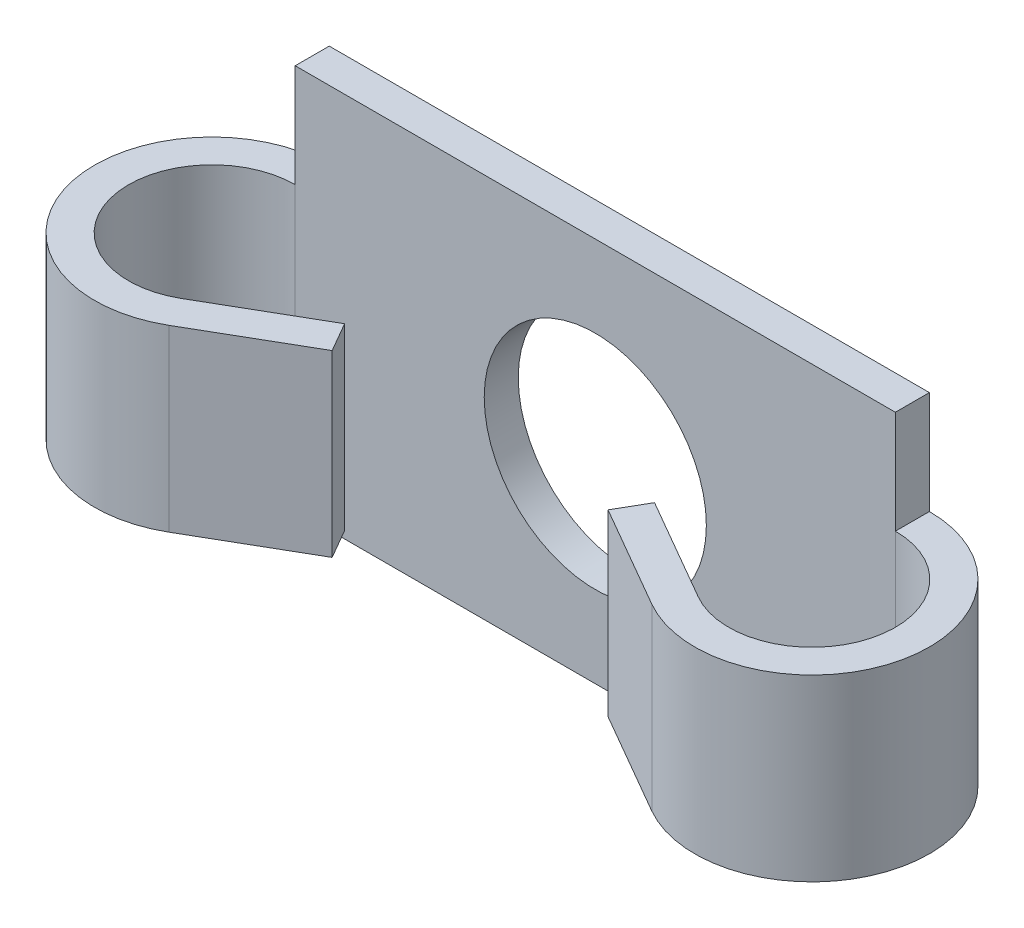
ISO-10303-21;
HEADER;
FILE_DESCRIPTION(('STEP AP214'),'2;1');
FILE_NAME('part.step','',(''),(''),'','','');
FILE_SCHEMA(('AUTOMOTIVE_DESIGN { 1 0 10303 214 1 1 1 1 }'));
ENDSEC;
DATA;
#1=APPLICATION_CONTEXT('core data for automotive mechanical design processes');
#2=APPLICATION_PROTOCOL_DEFINITION('international standard','automotive_design',2000,#1);
#3=PRODUCT_CONTEXT('',#1,'mechanical');
#4=PRODUCT('Part','Part','',(#3));
#5=PRODUCT_RELATED_PRODUCT_CATEGORY('part','',(#4));
#6=PRODUCT_DEFINITION_FORMATION('','',#4);
#7=PRODUCT_DEFINITION_CONTEXT('part definition',#1,'design');
#8=PRODUCT_DEFINITION('design','',#6,#7);
#9=PRODUCT_DEFINITION_SHAPE('','',#8);
#10=(LENGTH_UNIT() NAMED_UNIT(*) SI_UNIT(.MILLI.,.METRE.));
#11=(NAMED_UNIT(*) PLANE_ANGLE_UNIT() SI_UNIT($,.RADIAN.));
#12=(NAMED_UNIT(*) SI_UNIT($,.STERADIAN.) SOLID_ANGLE_UNIT());
#13=UNCERTAINTY_MEASURE_WITH_UNIT(LENGTH_MEASURE(1.E-05),#10,'distance_accuracy_value','');
#14=(GEOMETRIC_REPRESENTATION_CONTEXT(3) GLOBAL_UNCERTAINTY_ASSIGNED_CONTEXT((#13)) GLOBAL_UNIT_ASSIGNED_CONTEXT((#10,
#11,#12)) REPRESENTATION_CONTEXT('',''));
#15=CARTESIAN_POINT('',(0.,0.,0.));
#16=DIRECTION('',(0.,0.,1.));
#17=DIRECTION('',(1.,0.,0.));
#18=AXIS2_PLACEMENT_3D('',#15,#16,#17);
#19=CARTESIAN_POINT('',(16.75,-10.75,1.9));
#20=DIRECTION('',(-1.,0.,0.));
#21=DIRECTION('',(0.,0.,1.));
#22=AXIS2_PLACEMENT_3D('',#19,#20,#21);
#23=PLANE('',#22);
#24=DIRECTION('',(0.,0.,-1.));
#25=VECTOR('',#24,1.);
#26=CARTESIAN_POINT('',(16.75,-5.,1.9));
#27=LINE('',#26,#25);
#28=CARTESIAN_POINT('',(16.75,-5.,1.9));
#29=VERTEX_POINT('',#28);
#30=CARTESIAN_POINT('',(16.75,-5.,0.));
#31=VERTEX_POINT('',#30);
#32=EDGE_CURVE('E58',#29,#31,#27,.T.);
#33=ORIENTED_EDGE('',*,*,#32,.F.);
#34=DIRECTION('',(0.,1.,0.));
#35=VECTOR('',#34,1.);
#36=CARTESIAN_POINT('',(16.75,-10.75,1.9));
#37=LINE('',#36,#35);
#38=CARTESIAN_POINT('',(16.75,-10.75,1.9));
#39=VERTEX_POINT('',#38);
#40=EDGE_CURVE('E258',#39,#29,#37,.T.);
#41=ORIENTED_EDGE('',*,*,#40,.F.);
#42=DIRECTION('',(0.,0.,-1.));
#43=VECTOR('',#42,1.);
#44=CARTESIAN_POINT('',(16.75,-10.75,1.9));
#45=LINE('',#44,#43);
#46=CARTESIAN_POINT('',(16.75,-10.75,0.));
#47=VERTEX_POINT('',#46);
#48=EDGE_CURVE('E268',#39,#47,#45,.T.);
#49=ORIENTED_EDGE('',*,*,#48,.T.);
#50=DIRECTION('',(0.,1.,0.));
#51=VECTOR('',#50,1.);
#52=CARTESIAN_POINT('',(16.75,-10.75,0.));
#53=LINE('',#52,#51);
#54=EDGE_CURVE('E269',#47,#31,#53,.T.);
#55=ORIENTED_EDGE('',*,*,#54,.T.);
#56=EDGE_LOOP('',(#33,#41,#49,#55));
#57=FACE_BOUND('',#56,.T.);
#58=ADVANCED_FACE('F35',(#57),#23,.F.);
#59=CARTESIAN_POINT('',(-16.75,-10.75,1.9));
#60=DIRECTION('',(1.,0.,0.));
#61=DIRECTION('',(0.,0.,-1.));
#62=AXIS2_PLACEMENT_3D('',#59,#60,#61);
#63=PLANE('',#62);
#64=DIRECTION('',(0.,0.,-1.));
#65=VECTOR('',#64,1.);
#66=CARTESIAN_POINT('',(-16.75,-5.,1.9));
#67=LINE('',#66,#65);
#68=CARTESIAN_POINT('',(-16.75,-5.,1.9));
#69=VERTEX_POINT('',#68);
#70=CARTESIAN_POINT('',(-16.75,-5.,0.));
#71=VERTEX_POINT('',#70);
#72=EDGE_CURVE('E226',#69,#71,#67,.T.);
#73=ORIENTED_EDGE('',*,*,#72,.T.);
#74=DIRECTION('',(0.,-1.,0.));
#75=VECTOR('',#74,1.);
#76=CARTESIAN_POINT('',(-16.75,-10.75,0.));
#77=LINE('',#76,#75);
#78=CARTESIAN_POINT('',(-16.75,-10.75,0.));
#79=VERTEX_POINT('',#78);
#80=EDGE_CURVE('E273',#71,#79,#77,.T.);
#81=ORIENTED_EDGE('',*,*,#80,.T.);
#82=DIRECTION('',(0.,0.,-1.));
#83=VECTOR('',#82,1.);
#84=CARTESIAN_POINT('',(-16.75,-10.75,1.9));
#85=LINE('',#84,#83);
#86=CARTESIAN_POINT('',(-16.75,-10.75,1.9));
#87=VERTEX_POINT('',#86);
#88=EDGE_CURVE('E281',#87,#79,#85,.T.);
#89=ORIENTED_EDGE('',*,*,#88,.F.);
#90=DIRECTION('',(0.,-1.,0.));
#91=VECTOR('',#90,1.);
#92=CARTESIAN_POINT('',(-16.75,-10.75,1.9));
#93=LINE('',#92,#91);
#94=EDGE_CURVE('E262',#69,#87,#93,.T.);
#95=ORIENTED_EDGE('',*,*,#94,.F.);
#96=EDGE_LOOP('',(#73,#81,#89,#95));
#97=FACE_BOUND('',#96,.T.);
#98=ADVANCED_FACE('F352',(#97),#63,.F.);
#99=CARTESIAN_POINT('',(0.,0.,1.9));
#100=DIRECTION('',(0.,0.,-1.));
#101=DIRECTION('',(-1.,0.,0.));
#102=AXIS2_PLACEMENT_3D('',#99,#100,#101);
#103=PLANE('',#102);
#104=ORIENTED_EDGE('',*,*,#40,.T.);
#105=DIRECTION('',(0.,-1.,0.));
#106=VECTOR('',#105,1.);
#107=CARTESIAN_POINT('',(16.75,5.,1.9));
#108=LINE('',#107,#106);
#109=CARTESIAN_POINT('',(16.75,5.,1.9));
#110=VERTEX_POINT('',#109);
#111=EDGE_CURVE('E185',#110,#29,#108,.T.);
#112=ORIENTED_EDGE('',*,*,#111,.F.);
#113=CARTESIAN_POINT('',(16.75,10.75,1.9));
#114=VERTEX_POINT('',#113);
#115=EDGE_CURVE('E50',#110,#114,#37,.T.);
#116=ORIENTED_EDGE('',*,*,#115,.T.);
#117=DIRECTION('',(-1.,0.,0.));
#118=VECTOR('',#117,1.);
#119=CARTESIAN_POINT('',(-16.75,10.75,1.9));
#120=LINE('',#119,#118);
#121=CARTESIAN_POINT('',(-16.75,10.75,1.9));
#122=VERTEX_POINT('',#121);
#123=EDGE_CURVE('E260',#114,#122,#120,.T.);
#124=ORIENTED_EDGE('',*,*,#123,.T.);
#125=CARTESIAN_POINT('',(-16.75,5.,1.9));
#126=VERTEX_POINT('',#125);
#127=EDGE_CURVE('E263',#122,#126,#93,.T.);
#128=ORIENTED_EDGE('',*,*,#127,.T.);
#129=DIRECTION('',(0.,-1.,0.));
#130=VECTOR('',#129,1.);
#131=CARTESIAN_POINT('',(-16.75,5.,1.9));
#132=LINE('',#131,#130);
#133=EDGE_CURVE('E249',#126,#69,#132,.T.);
#134=ORIENTED_EDGE('',*,*,#133,.T.);
#135=ORIENTED_EDGE('',*,*,#94,.T.);
#136=DIRECTION('',(1.,0.,0.));
#137=VECTOR('',#136,1.);
#138=CARTESIAN_POINT('',(-16.75,-10.75,1.9));
#139=LINE('',#138,#137);
#140=EDGE_CURVE('E266',#87,#39,#139,.T.);
#141=ORIENTED_EDGE('',*,*,#140,.T.);
#142=EDGE_LOOP('',(#104,#112,#116,#124,#128,#134,#135,#141));
#143=FACE_BOUND('',#142,.T.);
#144=CARTESIAN_POINT('',(0.,0.,1.9));
#145=DIRECTION('',(0.,0.,1.));
#146=DIRECTION('',(1.,0.,0.));
#147=AXIS2_PLACEMENT_3D('',#144,#145,#146);
#148=CIRCLE('',#147,6.2);
#149=CARTESIAN_POINT('',(6.2,0.,1.9));
#150=VERTEX_POINT('',#149);
#151=EDGE_CURVE('E252',#150,#150,#148,.T.);
#152=ORIENTED_EDGE('',*,*,#151,.F.);
#153=EDGE_LOOP('',(#152));
#154=FACE_BOUND('',#153,.T.);
#155=ADVANCED_FACE('F326',(#143,#154),#103,.F.);
#156=CARTESIAN_POINT('',(0.,0.,0.));
#157=DIRECTION('',(0.,0.,-1.));
#158=DIRECTION('',(-1.,0.,0.));
#159=AXIS2_PLACEMENT_3D('',#156,#157,#158);
#160=PLANE('',#159);
#161=ORIENTED_EDGE('',*,*,#54,.F.);
#162=DIRECTION('',(1.,0.,0.));
#163=VECTOR('',#162,1.);
#164=CARTESIAN_POINT('',(-16.75,-10.75,0.));
#165=LINE('',#164,#163);
#166=EDGE_CURVE('E277',#79,#47,#165,.T.);
#167=ORIENTED_EDGE('',*,*,#166,.F.);
#168=ORIENTED_EDGE('',*,*,#80,.F.);
#169=DIRECTION('',(0.,-1.,0.));
#170=VECTOR('',#169,1.);
#171=CARTESIAN_POINT('',(-16.75,5.,0.));
#172=LINE('',#171,#170);
#173=CARTESIAN_POINT('',(-16.75,5.,0.));
#174=VERTEX_POINT('',#173);
#175=EDGE_CURVE('E246',#174,#71,#172,.T.);
#176=ORIENTED_EDGE('',*,*,#175,.F.);
#177=CARTESIAN_POINT('',(-16.75,10.75,0.));
#178=VERTEX_POINT('',#177);
#179=EDGE_CURVE('E274',#178,#174,#77,.T.);
#180=ORIENTED_EDGE('',*,*,#179,.F.);
#181=DIRECTION('',(-1.,0.,0.));
#182=VECTOR('',#181,1.);
#183=CARTESIAN_POINT('',(-16.75,10.75,0.));
#184=LINE('',#183,#182);
#185=CARTESIAN_POINT('',(16.75,10.75,0.));
#186=VERTEX_POINT('',#185);
#187=EDGE_CURVE('E271',#186,#178,#184,.T.);
#188=ORIENTED_EDGE('',*,*,#187,.F.);
#189=CARTESIAN_POINT('',(16.75,5.,0.));
#190=VERTEX_POINT('',#189);
#191=EDGE_CURVE('E255',#190,#186,#53,.T.);
#192=ORIENTED_EDGE('',*,*,#191,.F.);
#193=DIRECTION('',(0.,-1.,0.));
#194=VECTOR('',#193,1.);
#195=CARTESIAN_POINT('',(16.75,5.,0.));
#196=LINE('',#195,#194);
#197=EDGE_CURVE('E200',#190,#31,#196,.T.);
#198=ORIENTED_EDGE('',*,*,#197,.T.);
#199=EDGE_LOOP('',(#161,#167,#168,#176,#180,#188,#192,#198));
#200=FACE_BOUND('',#199,.T.);
#201=CARTESIAN_POINT('',(0.,0.,0.));
#202=DIRECTION('',(0.,0.,1.));
#203=DIRECTION('',(1.,0.,0.));
#204=AXIS2_PLACEMENT_3D('',#201,#202,#203);
#205=CIRCLE('',#204,6.2);
#206=CARTESIAN_POINT('',(6.2,0.,0.));
#207=VERTEX_POINT('',#206);
#208=EDGE_CURVE('E251',#207,#207,#205,.T.);
#209=ORIENTED_EDGE('',*,*,#208,.T.);
#210=EDGE_LOOP('',(#209));
#211=FACE_BOUND('',#210,.T.);
#212=ADVANCED_FACE('F294',(#200,#211),#160,.T.);
#213=ORIENTED_EDGE('',*,*,#115,.F.);
#214=DIRECTION('',(0.,0.,-1.));
#215=VECTOR('',#214,1.);
#216=CARTESIAN_POINT('',(16.75,5.,1.9));
#217=LINE('',#216,#215);
#218=EDGE_CURVE('E171',#110,#190,#217,.T.);
#219=ORIENTED_EDGE('',*,*,#218,.T.);
#220=ORIENTED_EDGE('',*,*,#191,.T.);
#221=DIRECTION('',(0.,0.,-1.));
#222=VECTOR('',#221,1.);
#223=CARTESIAN_POINT('',(16.75,10.75,1.9));
#224=LINE('',#223,#222);
#225=EDGE_CURVE('E11',#114,#186,#224,.T.);
#226=ORIENTED_EDGE('',*,*,#225,.F.);
#227=EDGE_LOOP('',(#213,#219,#220,#226));
#228=FACE_BOUND('',#227,.T.);
#229=ADVANCED_FACE('F37',(#228),#23,.F.);
#230=CARTESIAN_POINT('',(-16.75,10.75,1.9));
#231=DIRECTION('',(0.,-1.,0.));
#232=DIRECTION('',(0.,0.,-1.));
#233=AXIS2_PLACEMENT_3D('',#230,#231,#232);
#234=PLANE('',#233);
#235=ORIENTED_EDGE('',*,*,#187,.T.);
#236=DIRECTION('',(0.,0.,-1.));
#237=VECTOR('',#236,1.);
#238=CARTESIAN_POINT('',(-16.75,10.75,1.9));
#239=LINE('',#238,#237);
#240=EDGE_CURVE('E43',#122,#178,#239,.T.);
#241=ORIENTED_EDGE('',*,*,#240,.F.);
#242=ORIENTED_EDGE('',*,*,#123,.F.);
#243=ORIENTED_EDGE('',*,*,#225,.T.);
#244=EDGE_LOOP('',(#235,#241,#242,#243));
#245=FACE_BOUND('',#244,.T.);
#246=ADVANCED_FACE('F329',(#245),#234,.F.);
#247=ORIENTED_EDGE('',*,*,#179,.T.);
#248=DIRECTION('',(0.,0.,-1.));
#249=VECTOR('',#248,1.);
#250=CARTESIAN_POINT('',(-16.75,5.,1.9));
#251=LINE('',#250,#249);
#252=EDGE_CURVE('E211',#126,#174,#251,.T.);
#253=ORIENTED_EDGE('',*,*,#252,.F.);
#254=ORIENTED_EDGE('',*,*,#127,.F.);
#255=ORIENTED_EDGE('',*,*,#240,.T.);
#256=EDGE_LOOP('',(#247,#253,#254,#255));
#257=FACE_BOUND('',#256,.T.);
#258=ADVANCED_FACE('F288',(#257),#63,.F.);
#259=CARTESIAN_POINT('',(-16.75,-10.75,1.9));
#260=DIRECTION('',(0.,1.,0.));
#261=DIRECTION('',(0.,0.,1.));
#262=AXIS2_PLACEMENT_3D('',#259,#260,#261);
#263=PLANE('',#262);
#264=ORIENTED_EDGE('',*,*,#166,.T.);
#265=ORIENTED_EDGE('',*,*,#48,.F.);
#266=ORIENTED_EDGE('',*,*,#140,.F.);
#267=ORIENTED_EDGE('',*,*,#88,.T.);
#268=EDGE_LOOP('',(#264,#265,#266,#267));
#269=FACE_BOUND('',#268,.T.);
#270=ADVANCED_FACE('F370',(#269),#263,.F.);
#271=CARTESIAN_POINT('',(0.,0.,1.9));
#272=DIRECTION('',(0.,0.,-1.));
#273=DIRECTION('',(-1.,0.,0.));
#274=AXIS2_PLACEMENT_3D('',#271,#272,#273);
#275=CYLINDRICAL_SURFACE('',#274,6.2);
#276=ORIENTED_EDGE('',*,*,#151,.T.);
#277=EDGE_LOOP('',(#276));
#278=FACE_BOUND('',#277,.T.);
#279=ORIENTED_EDGE('',*,*,#208,.F.);
#280=EDGE_LOOP('',(#279));
#281=FACE_BOUND('',#280,.T.);
#282=ADVANCED_FACE('F372',(#278,#281),#275,.F.);
#283=CARTESIAN_POINT('',(-16.75,5.,6.55));
#284=DIRECTION('',(0.,-1.,0.));
#285=DIRECTION('',(0.,0.,-1.));
#286=AXIS2_PLACEMENT_3D('',#283,#284,#285);
#287=CYLINDRICAL_SURFACE('',#286,4.65);
#288=CARTESIAN_POINT('',(-16.75,-5.,6.55));
#289=DIRECTION('',(0.,-1.,0.));
#290=DIRECTION('',(0.,0.,1.));
#291=AXIS2_PLACEMENT_3D('',#288,#289,#290);
#292=CIRCLE('',#291,4.65);
#293=CARTESIAN_POINT('',(-14.425,-5.,10.5770181275977));
#294=VERTEX_POINT('',#293);
#295=EDGE_CURVE('E161',#294,#69,#292,.T.);
#296=ORIENTED_EDGE('',*,*,#295,.T.);
#297=ORIENTED_EDGE('',*,*,#133,.F.);
#298=CARTESIAN_POINT('',(-16.75,5.,6.55));
#299=DIRECTION('',(0.,-1.,0.));
#300=DIRECTION('',(0.,0.,1.));
#301=AXIS2_PLACEMENT_3D('',#298,#299,#300);
#302=CIRCLE('',#301,4.65);
#303=CARTESIAN_POINT('',(-14.425,5.,10.5770181275977));
#304=VERTEX_POINT('',#303);
#305=EDGE_CURVE('E208',#304,#126,#302,.T.);
#306=ORIENTED_EDGE('',*,*,#305,.F.);
#307=DIRECTION('',(0.,-1.,0.));
#308=VECTOR('',#307,1.);
#309=CARTESIAN_POINT('',(-14.425,5.,10.5770181275977));
#310=LINE('',#309,#308);
#311=EDGE_CURVE('E223',#304,#294,#310,.T.);
#312=ORIENTED_EDGE('',*,*,#311,.T.);
#313=EDGE_LOOP('',(#296,#297,#306,#312));
#314=FACE_BOUND('',#313,.T.);
#315=ADVANCED_FACE('F391',(#314),#287,.F.);
#316=CARTESIAN_POINT('',(-16.75,5.,6.55));
#317=DIRECTION('',(0.,-1.,0.));
#318=DIRECTION('',(0.,0.,-1.));
#319=AXIS2_PLACEMENT_3D('',#316,#317,#318);
#320=CYLINDRICAL_SURFACE('',#319,6.55);
#321=CARTESIAN_POINT('',(-16.75,-5.,6.55));
#322=DIRECTION('',(0.,1.,0.));
#323=DIRECTION('',(0.,0.,1.));
#324=AXIS2_PLACEMENT_3D('',#321,#322,#323);
#325=CIRCLE('',#324,6.55);
#326=CARTESIAN_POINT('',(-13.475,-5.,12.2224663947881));
#327=VERTEX_POINT('',#326);
#328=EDGE_CURVE('E228',#71,#327,#325,.T.);
#329=ORIENTED_EDGE('',*,*,#328,.T.);
#330=DIRECTION('',(0.,-1.,0.));
#331=VECTOR('',#330,1.);
#332=CARTESIAN_POINT('',(-13.475,5.,12.2224663947881));
#333=LINE('',#332,#331);
#334=CARTESIAN_POINT('',(-13.475,5.,12.2224663947881));
#335=VERTEX_POINT('',#334);
#336=EDGE_CURVE('E243',#335,#327,#333,.T.);
#337=ORIENTED_EDGE('',*,*,#336,.F.);
#338=CARTESIAN_POINT('',(-16.75,5.,6.55));
#339=DIRECTION('',(0.,1.,0.));
#340=DIRECTION('',(0.,0.,1.));
#341=AXIS2_PLACEMENT_3D('',#338,#339,#340);
#342=CIRCLE('',#341,6.55);
#343=EDGE_CURVE('E215',#174,#335,#342,.T.);
#344=ORIENTED_EDGE('',*,*,#343,.F.);
#345=ORIENTED_EDGE('',*,*,#175,.T.);
#346=EDGE_LOOP('',(#329,#337,#344,#345));
#347=FACE_BOUND('',#346,.T.);
#348=ADVANCED_FACE('F302',(#347),#320,.T.);
#349=CARTESIAN_POINT('',(-7.7,5.,8.88826859021803));
#350=DIRECTION('',(-0.499999999999995,0.,-0.866025403784442));
#351=DIRECTION('',(-0.866025403784442,0.,0.499999999999995));
#352=AXIS2_PLACEMENT_3D('',#349,#350,#351);
#353=PLANE('',#352);
#354=DIRECTION('',(0.866025403784441,0.,-0.499999999999995));
#355=VECTOR('',#354,1.);
#356=CARTESIAN_POINT('',(-7.7,-5.,8.88826859021803));
#357=LINE('',#356,#355);
#358=CARTESIAN_POINT('',(-7.7,-5.,8.88826859021803));
#359=VERTEX_POINT('',#358);
#360=EDGE_CURVE('E230',#327,#359,#357,.T.);
#361=ORIENTED_EDGE('',*,*,#360,.T.);
#362=DIRECTION('',(0.,-1.,0.));
#363=VECTOR('',#362,1.);
#364=CARTESIAN_POINT('',(-7.7,5.,8.88826859021803));
#365=LINE('',#364,#363);
#366=CARTESIAN_POINT('',(-7.7,5.,8.88826859021803));
#367=VERTEX_POINT('',#366);
#368=EDGE_CURVE('E240',#367,#359,#365,.T.);
#369=ORIENTED_EDGE('',*,*,#368,.F.);
#370=DIRECTION('',(0.866025403784441,0.,-0.499999999999995));
#371=VECTOR('',#370,1.);
#372=CARTESIAN_POINT('',(-7.7,5.,8.88826859021803));
#373=LINE('',#372,#371);
#374=EDGE_CURVE('E217',#335,#367,#373,.T.);
#375=ORIENTED_EDGE('',*,*,#374,.F.);
#376=ORIENTED_EDGE('',*,*,#336,.T.);
#377=EDGE_LOOP('',(#361,#369,#375,#376));
#378=FACE_BOUND('',#377,.T.);
#379=ADVANCED_FACE('F313',(#378),#353,.F.);
#380=CARTESIAN_POINT('',(-8.64999999999999,5.,7.24282032302759));
#381=DIRECTION('',(-0.866025403784441,0.,0.499999999999995));
#382=DIRECTION('',(0.499999999999995,0.,0.866025403784441));
#383=AXIS2_PLACEMENT_3D('',#380,#381,#382);
#384=PLANE('',#383);
#385=DIRECTION('',(-0.499999999999995,0.,-0.866025403784441));
#386=VECTOR('',#385,1.);
#387=CARTESIAN_POINT('',(-8.64999999999999,-5.,7.24282032302759));
#388=LINE('',#387,#386);
#389=CARTESIAN_POINT('',(-8.64999999999999,-5.,7.24282032302759));
#390=VERTEX_POINT('',#389);
#391=EDGE_CURVE('E232',#359,#390,#388,.T.);
#392=ORIENTED_EDGE('',*,*,#391,.T.);
#393=DIRECTION('',(0.,-1.,0.));
#394=VECTOR('',#393,1.);
#395=CARTESIAN_POINT('',(-8.64999999999999,5.,7.24282032302759));
#396=LINE('',#395,#394);
#397=CARTESIAN_POINT('',(-8.64999999999999,5.,7.24282032302759));
#398=VERTEX_POINT('',#397);
#399=EDGE_CURVE('E237',#398,#390,#396,.T.);
#400=ORIENTED_EDGE('',*,*,#399,.F.);
#401=DIRECTION('',(-0.499999999999995,0.,-0.866025403784441));
#402=VECTOR('',#401,1.);
#403=CARTESIAN_POINT('',(-8.64999999999999,5.,7.24282032302759));
#404=LINE('',#403,#402);
#405=EDGE_CURVE('E219',#367,#398,#404,.T.);
#406=ORIENTED_EDGE('',*,*,#405,.F.);
#407=ORIENTED_EDGE('',*,*,#368,.T.);
#408=EDGE_LOOP('',(#392,#400,#406,#407));
#409=FACE_BOUND('',#408,.T.);
#410=ADVANCED_FACE('F317',(#409),#384,.F.);
#411=CARTESIAN_POINT('',(-14.425,5.,10.5770181275977));
#412=DIRECTION('',(0.499999999999995,0.,0.866025403784441));
#413=DIRECTION('',(0.866025403784441,0.,-0.499999999999995));
#414=AXIS2_PLACEMENT_3D('',#411,#412,#413);
#415=PLANE('',#414);
#416=DIRECTION('',(-0.866025403784441,0.,0.499999999999995));
#417=VECTOR('',#416,1.);
#418=CARTESIAN_POINT('',(-14.425,-5.,10.5770181275977));
#419=LINE('',#418,#417);
#420=EDGE_CURVE('E212',#390,#294,#419,.T.);
#421=ORIENTED_EDGE('',*,*,#420,.T.);
#422=ORIENTED_EDGE('',*,*,#311,.F.);
#423=DIRECTION('',(-0.866025403784441,0.,0.499999999999995));
#424=VECTOR('',#423,1.);
#425=CARTESIAN_POINT('',(-14.425,5.,10.5770181275977));
#426=LINE('',#425,#424);
#427=EDGE_CURVE('E221',#398,#304,#426,.T.);
#428=ORIENTED_EDGE('',*,*,#427,.F.);
#429=ORIENTED_EDGE('',*,*,#399,.T.);
#430=EDGE_LOOP('',(#421,#422,#428,#429));
#431=FACE_BOUND('',#430,.T.);
#432=ADVANCED_FACE('F416',(#431),#415,.F.);
#433=CARTESIAN_POINT('',(-16.75,5.,6.55));
#434=DIRECTION('',(0.,1.,0.));
#435=DIRECTION('',(0.,0.,1.));
#436=AXIS2_PLACEMENT_3D('',#433,#434,#435);
#437=PLANE('',#436);
#438=ORIENTED_EDGE('',*,*,#305,.T.);
#439=ORIENTED_EDGE('',*,*,#252,.T.);
#440=ORIENTED_EDGE('',*,*,#343,.T.);
#441=ORIENTED_EDGE('',*,*,#374,.T.);
#442=ORIENTED_EDGE('',*,*,#405,.T.);
#443=ORIENTED_EDGE('',*,*,#427,.T.);
#444=EDGE_LOOP('',(#438,#439,#440,#441,#442,#443));
#445=FACE_BOUND('',#444,.T.);
#446=ADVANCED_FACE('F321',(#445),#437,.T.);
#447=CARTESIAN_POINT('',(-16.75,-5.,6.55));
#448=DIRECTION('',(0.,1.,0.));
#449=DIRECTION('',(0.,0.,1.));
#450=AXIS2_PLACEMENT_3D('',#447,#448,#449);
#451=PLANE('',#450);
#452=ORIENTED_EDGE('',*,*,#295,.F.);
#453=ORIENTED_EDGE('',*,*,#420,.F.);
#454=ORIENTED_EDGE('',*,*,#391,.F.);
#455=ORIENTED_EDGE('',*,*,#360,.F.);
#456=ORIENTED_EDGE('',*,*,#328,.F.);
#457=ORIENTED_EDGE('',*,*,#72,.F.);
#458=EDGE_LOOP('',(#452,#453,#454,#455,#456,#457));
#459=FACE_BOUND('',#458,.T.);
#460=ADVANCED_FACE('F308',(#459),#451,.F.);
#461=CARTESIAN_POINT('',(16.75,5.,6.55));
#462=DIRECTION('',(0.,-1.,0.));
#463=DIRECTION('',(0.,0.,-1.));
#464=AXIS2_PLACEMENT_3D('',#461,#462,#463);
#465=CYLINDRICAL_SURFACE('',#464,4.65);
#466=CARTESIAN_POINT('',(16.75,-5.,6.55));
#467=DIRECTION('',(0.,1.,0.));
#468=DIRECTION('',(0.,0.,1.));
#469=AXIS2_PLACEMENT_3D('',#466,#467,#468);
#470=CIRCLE('',#469,4.65);
#471=CARTESIAN_POINT('',(14.425,-5.,10.5770181275977));
#472=VERTEX_POINT('',#471);
#473=EDGE_CURVE('E156',#472,#29,#470,.T.);
#474=ORIENTED_EDGE('',*,*,#473,.F.);
#475=DIRECTION('',(0.,-1.,0.));
#476=VECTOR('',#475,1.);
#477=CARTESIAN_POINT('',(14.425,5.,10.5770181275977));
#478=LINE('',#477,#476);
#479=CARTESIAN_POINT('',(14.425,5.,10.5770181275977));
#480=VERTEX_POINT('',#479);
#481=EDGE_CURVE('E149',#480,#472,#478,.T.);
#482=ORIENTED_EDGE('',*,*,#481,.F.);
#483=CARTESIAN_POINT('',(16.75,5.,6.55));
#484=DIRECTION('',(0.,1.,0.));
#485=DIRECTION('',(0.,0.,1.));
#486=AXIS2_PLACEMENT_3D('',#483,#484,#485);
#487=CIRCLE('',#486,4.65);
#488=EDGE_CURVE('E153',#480,#110,#487,.T.);
#489=ORIENTED_EDGE('',*,*,#488,.T.);
#490=ORIENTED_EDGE('',*,*,#111,.T.);
#491=EDGE_LOOP('',(#474,#482,#489,#490));
#492=FACE_BOUND('',#491,.T.);
#493=ADVANCED_FACE('F151',(#492),#465,.F.);
#494=CARTESIAN_POINT('',(14.425,5.,10.5770181275977));
#495=DIRECTION('',(0.499999999999995,0.,-0.866025403784441));
#496=DIRECTION('',(-0.866025403784441,0.,-0.499999999999995));
#497=AXIS2_PLACEMENT_3D('',#494,#495,#496);
#498=PLANE('',#497);
#499=DIRECTION('',(0.866025403784441,0.,0.499999999999995));
#500=VECTOR('',#499,1.);
#501=CARTESIAN_POINT('',(14.425,-5.,10.5770181275977));
#502=LINE('',#501,#500);
#503=CARTESIAN_POINT('',(8.64999999999999,-5.,7.24282032302759));
#504=VERTEX_POINT('',#503);
#505=EDGE_CURVE('E187',#504,#472,#502,.T.);
#506=ORIENTED_EDGE('',*,*,#505,.F.);
#507=DIRECTION('',(0.,-1.,0.));
#508=VECTOR('',#507,1.);
#509=CARTESIAN_POINT('',(8.64999999999999,5.,7.24282032302759));
#510=LINE('',#509,#508);
#511=CARTESIAN_POINT('',(8.64999999999999,5.,7.24282032302759));
#512=VERTEX_POINT('',#511);
#513=EDGE_CURVE('E162',#512,#504,#510,.T.);
#514=ORIENTED_EDGE('',*,*,#513,.F.);
#515=DIRECTION('',(0.866025403784441,0.,0.499999999999995));
#516=VECTOR('',#515,1.);
#517=CARTESIAN_POINT('',(14.425,5.,10.5770181275977));
#518=LINE('',#517,#516);
#519=EDGE_CURVE('E168',#512,#480,#518,.T.);
#520=ORIENTED_EDGE('',*,*,#519,.T.);
#521=ORIENTED_EDGE('',*,*,#481,.T.);
#522=EDGE_LOOP('',(#506,#514,#520,#521));
#523=FACE_BOUND('',#522,.T.);
#524=ADVANCED_FACE('F173',(#523),#498,.T.);
#525=CARTESIAN_POINT('',(8.64999999999999,5.,7.24282032302759));
#526=DIRECTION('',(-0.866025403784441,0.,-0.499999999999995));
#527=DIRECTION('',(-0.499999999999995,0.,0.866025403784441));
#528=AXIS2_PLACEMENT_3D('',#525,#526,#527);
#529=PLANE('',#528);
#530=DIRECTION('',(0.499999999999995,0.,-0.866025403784441));
#531=VECTOR('',#530,1.);
#532=CARTESIAN_POINT('',(8.64999999999999,-5.,7.24282032302759));
#533=LINE('',#532,#531);
#534=CARTESIAN_POINT('',(7.7,-5.,8.88826859021803));
#535=VERTEX_POINT('',#534);
#536=EDGE_CURVE('E189',#535,#504,#533,.T.);
#537=ORIENTED_EDGE('',*,*,#536,.F.);
#538=DIRECTION('',(0.,-1.,0.));
#539=VECTOR('',#538,1.);
#540=CARTESIAN_POINT('',(7.7,5.,8.88826859021803));
#541=LINE('',#540,#539);
#542=CARTESIAN_POINT('',(7.7,5.,8.88826859021803));
#543=VERTEX_POINT('',#542);
#544=EDGE_CURVE('E205',#543,#535,#541,.T.);
#545=ORIENTED_EDGE('',*,*,#544,.F.);
#546=DIRECTION('',(0.499999999999995,0.,-0.866025403784441));
#547=VECTOR('',#546,1.);
#548=CARTESIAN_POINT('',(8.64999999999999,5.,7.24282032302759));
#549=LINE('',#548,#547);
#550=EDGE_CURVE('E174',#543,#512,#549,.T.);
#551=ORIENTED_EDGE('',*,*,#550,.T.);
#552=ORIENTED_EDGE('',*,*,#513,.T.);
#553=EDGE_LOOP('',(#537,#545,#551,#552));
#554=FACE_BOUND('',#553,.T.);
#555=ADVANCED_FACE('F342',(#554),#529,.T.);
#556=CARTESIAN_POINT('',(7.7,5.,8.88826859021803));
#557=DIRECTION('',(-0.499999999999995,0.,0.866025403784442));
#558=DIRECTION('',(0.866025403784442,0.,0.499999999999995));
#559=AXIS2_PLACEMENT_3D('',#556,#557,#558);
#560=PLANE('',#559);
#561=DIRECTION('',(-0.866025403784441,0.,-0.499999999999995));
#562=VECTOR('',#561,1.);
#563=CARTESIAN_POINT('',(7.7,-5.,8.88826859021803));
#564=LINE('',#563,#562);
#565=CARTESIAN_POINT('',(13.475,-5.,12.2224663947881));
#566=VERTEX_POINT('',#565);
#567=EDGE_CURVE('E192',#566,#535,#564,.T.);
#568=ORIENTED_EDGE('',*,*,#567,.F.);
#569=DIRECTION('',(0.,-1.,0.));
#570=VECTOR('',#569,1.);
#571=CARTESIAN_POINT('',(13.475,5.,12.2224663947881));
#572=LINE('',#571,#570);
#573=CARTESIAN_POINT('',(13.475,5.,12.2224663947881));
#574=VERTEX_POINT('',#573);
#575=EDGE_CURVE('E203',#574,#566,#572,.T.);
#576=ORIENTED_EDGE('',*,*,#575,.F.);
#577=DIRECTION('',(-0.866025403784441,0.,-0.499999999999995));
#578=VECTOR('',#577,1.);
#579=CARTESIAN_POINT('',(7.7,5.,8.88826859021803));
#580=LINE('',#579,#578);
#581=EDGE_CURVE('E176',#574,#543,#580,.T.);
#582=ORIENTED_EDGE('',*,*,#581,.T.);
#583=ORIENTED_EDGE('',*,*,#544,.T.);
#584=EDGE_LOOP('',(#568,#576,#582,#583));
#585=FACE_BOUND('',#584,.T.);
#586=ADVANCED_FACE('F337',(#585),#560,.T.);
#587=CARTESIAN_POINT('',(16.75,5.,6.55));
#588=DIRECTION('',(0.,-1.,0.));
#589=DIRECTION('',(0.,0.,-1.));
#590=AXIS2_PLACEMENT_3D('',#587,#588,#589);
#591=CYLINDRICAL_SURFACE('',#590,6.55);
#592=CARTESIAN_POINT('',(16.75,-5.,6.55));
#593=DIRECTION('',(0.,-1.,0.));
#594=DIRECTION('',(0.,0.,1.));
#595=AXIS2_PLACEMENT_3D('',#592,#593,#594);
#596=CIRCLE('',#595,6.55);
#597=EDGE_CURVE('E195',#31,#566,#596,.T.);
#598=ORIENTED_EDGE('',*,*,#597,.F.);
#599=ORIENTED_EDGE('',*,*,#197,.F.);
#600=CARTESIAN_POINT('',(16.75,5.,6.55));
#601=DIRECTION('',(0.,-1.,0.));
#602=DIRECTION('',(0.,0.,1.));
#603=AXIS2_PLACEMENT_3D('',#600,#601,#602);
#604=CIRCLE('',#603,6.55);
#605=EDGE_CURVE('E181',#190,#574,#604,.T.);
#606=ORIENTED_EDGE('',*,*,#605,.T.);
#607=ORIENTED_EDGE('',*,*,#575,.T.);
#608=EDGE_LOOP('',(#598,#599,#606,#607));
#609=FACE_BOUND('',#608,.T.);
#610=ADVANCED_FACE('F333',(#609),#591,.T.);
#611=CARTESIAN_POINT('',(16.75,5.,6.55));
#612=DIRECTION('',(0.,1.,0.));
#613=DIRECTION('',(0.,0.,1.));
#614=AXIS2_PLACEMENT_3D('',#611,#612,#613);
#615=PLANE('',#614);
#616=ORIENTED_EDGE('',*,*,#488,.F.);
#617=ORIENTED_EDGE('',*,*,#519,.F.);
#618=ORIENTED_EDGE('',*,*,#550,.F.);
#619=ORIENTED_EDGE('',*,*,#581,.F.);
#620=ORIENTED_EDGE('',*,*,#605,.F.);
#621=ORIENTED_EDGE('',*,*,#218,.F.);
#622=EDGE_LOOP('',(#616,#617,#618,#619,#620,#621));
#623=FACE_BOUND('',#622,.T.);
#624=ADVANCED_FACE('F166',(#623),#615,.T.);
#625=CARTESIAN_POINT('',(16.75,-5.,6.55));
#626=DIRECTION('',(0.,1.,0.));
#627=DIRECTION('',(0.,0.,1.));
#628=AXIS2_PLACEMENT_3D('',#625,#626,#627);
#629=PLANE('',#628);
#630=ORIENTED_EDGE('',*,*,#473,.T.);
#631=ORIENTED_EDGE('',*,*,#32,.T.);
#632=ORIENTED_EDGE('',*,*,#597,.T.);
#633=ORIENTED_EDGE('',*,*,#567,.T.);
#634=ORIENTED_EDGE('',*,*,#536,.T.);
#635=ORIENTED_EDGE('',*,*,#505,.T.);
#636=EDGE_LOOP('',(#630,#631,#632,#633,#634,#635));
#637=FACE_BOUND('',#636,.T.);
#638=ADVANCED_FACE('F340',(#637),#629,.F.);
#639=CLOSED_SHELL('',(#58,#98,#155,#212,#229,#246,#258,#270,#282,#315,#348,#379,#410,#432,#446,
#460,#493,#524,#555,#586,#610,#624,#638));
#640=MANIFOLD_SOLID_BREP('B2',#639);
#641=ADVANCED_BREP_SHAPE_REPRESENTATION('',(#18,#640),#14);
#642=SHAPE_DEFINITION_REPRESENTATION(#9,#641);
ENDSEC;
END-ISO-10303-21;
